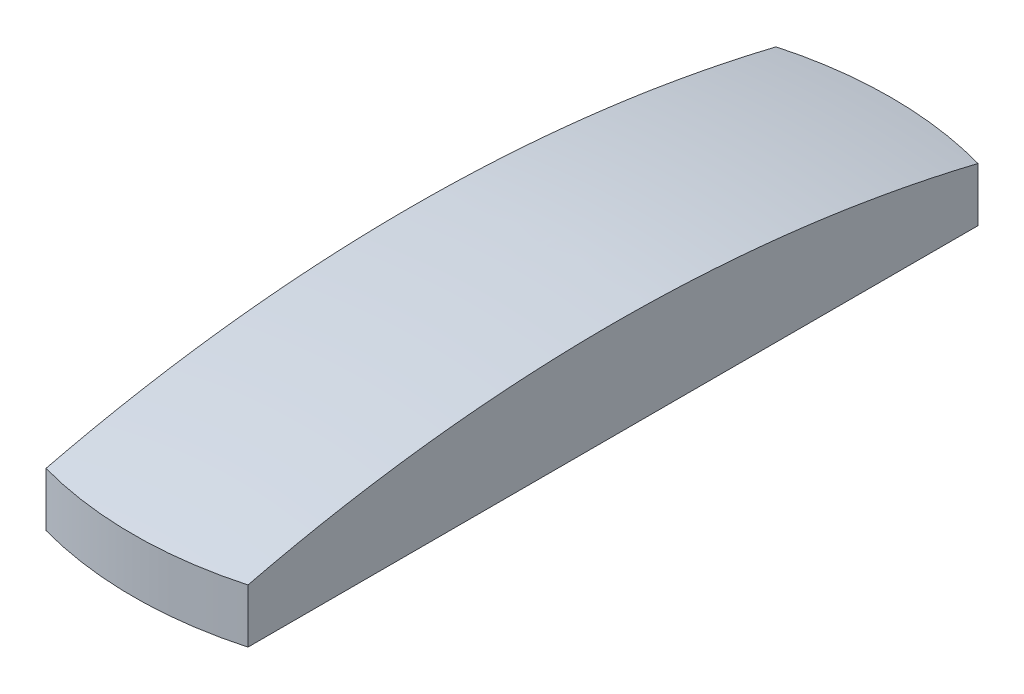
ISO-10303-21;
HEADER;
FILE_DESCRIPTION(('STEP AP214'),'2;1');
FILE_NAME('part.step','',(''),(''),'','','');
FILE_SCHEMA(('AUTOMOTIVE_DESIGN { 1 0 10303 214 1 1 1 1 }'));
ENDSEC;
DATA;
#1=APPLICATION_CONTEXT('core data for automotive mechanical design processes');
#2=APPLICATION_PROTOCOL_DEFINITION('international standard','automotive_design',2000,#1);
#3=PRODUCT_CONTEXT('',#1,'mechanical');
#4=PRODUCT('Part','Part','',(#3));
#5=PRODUCT_RELATED_PRODUCT_CATEGORY('part','',(#4));
#6=PRODUCT_DEFINITION_FORMATION('','',#4);
#7=PRODUCT_DEFINITION_CONTEXT('part definition',#1,'design');
#8=PRODUCT_DEFINITION('design','',#6,#7);
#9=PRODUCT_DEFINITION_SHAPE('','',#8);
#10=(LENGTH_UNIT() NAMED_UNIT(*) SI_UNIT(.MILLI.,.METRE.));
#11=(NAMED_UNIT(*) PLANE_ANGLE_UNIT() SI_UNIT($,.RADIAN.));
#12=(NAMED_UNIT(*) SI_UNIT($,.STERADIAN.) SOLID_ANGLE_UNIT());
#13=UNCERTAINTY_MEASURE_WITH_UNIT(LENGTH_MEASURE(1.E-05),#10,'distance_accuracy_value','');
#14=(GEOMETRIC_REPRESENTATION_CONTEXT(3) GLOBAL_UNCERTAINTY_ASSIGNED_CONTEXT((#13)) GLOBAL_UNIT_ASSIGNED_CONTEXT((#10,
#11,#12)) REPRESENTATION_CONTEXT('',''));
#15=CARTESIAN_POINT('',(0.,0.,0.));
#16=DIRECTION('',(0.,0.,1.));
#17=DIRECTION('',(1.,0.,0.));
#18=AXIS2_PLACEMENT_3D('',#15,#16,#17);
#19=CARTESIAN_POINT('',(0.,2.,0.));
#20=DIRECTION('',(0.,1.,0.));
#21=DIRECTION('',(0.,0.,1.));
#22=AXIS2_PLACEMENT_3D('',#19,#20,#21);
#23=CYLINDRICAL_SURFACE('',#22,7.5);
#24=CARTESIAN_POINT('',(0.,0.,0.));
#25=DIRECTION('',(0.,1.,0.));
#26=DIRECTION('',(0.,0.,1.));
#27=AXIS2_PLACEMENT_3D('',#24,#25,#26);
#28=CIRCLE('',#27,7.5);
#29=CARTESIAN_POINT('',(-2.,0.,7.22841614740048));
#30=VERTEX_POINT('',#29);
#31=CARTESIAN_POINT('',(2.,0.,7.22841614740048));
#32=VERTEX_POINT('',#31);
#33=EDGE_CURVE('E82',#30,#32,#28,.T.);
#34=ORIENTED_EDGE('',*,*,#33,.T.);
#35=DIRECTION('',(0.,1.,0.));
#36=VECTOR('',#35,1.);
#37=CARTESIAN_POINT('',(2.,2.,7.22841614740048));
#38=LINE('',#37,#36);
#39=CARTESIAN_POINT('',(2.,1.066647940069,7.22841614740048));
#40=VERTEX_POINT('',#39);
#41=EDGE_CURVE('E11',#32,#40,#38,.T.);
#42=ORIENTED_EDGE('',*,*,#41,.T.);
#43=CARTESIAN_POINT('',(0.,1.066647940069,0.));
#44=DIRECTION('',(0.,1.,0.));
#45=DIRECTION('',(0.,0.,1.));
#46=AXIS2_PLACEMENT_3D('',#43,#44,#45);
#47=CIRCLE('',#46,7.5);
#48=CARTESIAN_POINT('',(-2.,1.066647940069,7.22841614740048));
#49=VERTEX_POINT('',#48);
#50=EDGE_CURVE('E91',#49,#40,#47,.T.);
#51=ORIENTED_EDGE('',*,*,#50,.F.);
#52=DIRECTION('',(0.,1.,0.));
#53=VECTOR('',#52,1.);
#54=CARTESIAN_POINT('',(-2.,2.,7.22841614740048));
#55=LINE('',#54,#53);
#56=EDGE_CURVE('E86',#30,#49,#55,.T.);
#57=ORIENTED_EDGE('',*,*,#56,.F.);
#58=EDGE_LOOP('',(#34,#42,#51,#57));
#59=FACE_BOUND('',#58,.T.);
#60=ADVANCED_FACE('F31',(#59),#23,.T.);
#61=CARTESIAN_POINT('',(0.,-28.6,0.));
#62=DIRECTION('',(0.,1.,0.));
#63=DIRECTION('',(0.,0.,-1.));
#64=AXIS2_PLACEMENT_3D('',#61,#62,#63);
#65=SPHERICAL_SURFACE('',#64,30.6);
#66=ORIENTED_EDGE('',*,*,#50,.T.);
#67=CARTESIAN_POINT('',(2.,-28.6,0.));
#68=DIRECTION('',(-1.,0.,0.));
#69=DIRECTION('',(0.,0.,1.));
#70=AXIS2_PLACEMENT_3D('',#67,#68,#69);
#71=CIRCLE('',#70,30.5345705717307);
#72=CARTESIAN_POINT('',(2.,1.066647940069,-7.22841614740048));
#73=VERTEX_POINT('',#72);
#74=EDGE_CURVE('E72',#40,#73,#71,.T.);
#75=ORIENTED_EDGE('',*,*,#74,.T.);
#76=CARTESIAN_POINT('',(-2.,1.066647940069,-7.22841614740048));
#77=VERTEX_POINT('',#76);
#78=EDGE_CURVE('E54',#73,#77,#47,.T.);
#79=ORIENTED_EDGE('',*,*,#78,.T.);
#80=CARTESIAN_POINT('',(-2.,-28.6,0.));
#81=DIRECTION('',(-1.,0.,0.));
#82=DIRECTION('',(0.,0.,1.));
#83=AXIS2_PLACEMENT_3D('',#80,#81,#82);
#84=CIRCLE('',#83,30.5345705717307);
#85=EDGE_CURVE('E100',#49,#77,#84,.T.);
#86=ORIENTED_EDGE('',*,*,#85,.F.);
#87=EDGE_LOOP('',(#66,#75,#79,#86));
#88=FACE_BOUND('',#87,.T.);
#89=ADVANCED_FACE('F33',(#88),#65,.T.);
#90=CARTESIAN_POINT('',(0.,0.,0.));
#91=DIRECTION('',(0.,1.,0.));
#92=DIRECTION('',(0.,0.,1.));
#93=AXIS2_PLACEMENT_3D('',#90,#91,#92);
#94=PLANE('',#93);
#95=CARTESIAN_POINT('',(2.,0.,-7.22841614740048));
#96=VERTEX_POINT('',#95);
#97=CARTESIAN_POINT('',(-2.,0.,-7.22841614740048));
#98=VERTEX_POINT('',#97);
#99=EDGE_CURVE('E83',#96,#98,#28,.T.);
#100=ORIENTED_EDGE('',*,*,#99,.F.);
#101=DIRECTION('',(0.,0.,-1.));
#102=VECTOR('',#101,1.);
#103=CARTESIAN_POINT('',(2.,0.,-16.6414213562373));
#104=LINE('',#103,#102);
#105=EDGE_CURVE('E46',#32,#96,#104,.T.);
#106=ORIENTED_EDGE('',*,*,#105,.F.);
#107=ORIENTED_EDGE('',*,*,#33,.F.);
#108=DIRECTION('',(0.,0.,-1.));
#109=VECTOR('',#108,1.);
#110=CARTESIAN_POINT('',(-2.,0.,-16.6414213562373));
#111=LINE('',#110,#109);
#112=EDGE_CURVE('E98',#30,#98,#111,.T.);
#113=ORIENTED_EDGE('',*,*,#112,.T.);
#114=EDGE_LOOP('',(#100,#106,#107,#113));
#115=FACE_BOUND('',#114,.T.);
#116=ADVANCED_FACE('F80',(#115),#94,.F.);
#117=ORIENTED_EDGE('',*,*,#78,.F.);
#118=DIRECTION('',(0.,1.,0.));
#119=VECTOR('',#118,1.);
#120=CARTESIAN_POINT('',(2.,2.,-7.22841614740048));
#121=LINE('',#120,#119);
#122=EDGE_CURVE('E39',#73,#96,#121,.F.);
#123=ORIENTED_EDGE('',*,*,#122,.T.);
#124=ORIENTED_EDGE('',*,*,#99,.T.);
#125=DIRECTION('',(0.,1.,0.));
#126=VECTOR('',#125,1.);
#127=CARTESIAN_POINT('',(-2.,2.,-7.22841614740048));
#128=LINE('',#127,#126);
#129=EDGE_CURVE('E87',#77,#98,#128,.F.);
#130=ORIENTED_EDGE('',*,*,#129,.F.);
#131=EDGE_LOOP('',(#117,#123,#124,#130));
#132=FACE_BOUND('',#131,.T.);
#133=ADVANCED_FACE('F96',(#132),#23,.T.);
#134=CARTESIAN_POINT('',(-2.,2.,-16.6414213562373));
#135=DIRECTION('',(-1.,0.,0.));
#136=DIRECTION('',(0.,0.,1.));
#137=AXIS2_PLACEMENT_3D('',#134,#135,#136);
#138=PLANE('',#137);
#139=ORIENTED_EDGE('',*,*,#85,.T.);
#140=ORIENTED_EDGE('',*,*,#129,.T.);
#141=ORIENTED_EDGE('',*,*,#112,.F.);
#142=ORIENTED_EDGE('',*,*,#56,.T.);
#143=EDGE_LOOP('',(#139,#140,#141,#142));
#144=FACE_BOUND('',#143,.T.);
#145=ADVANCED_FACE('F103',(#144),#138,.T.);
#146=CARTESIAN_POINT('',(2.,2.,-16.6414213562373));
#147=DIRECTION('',(-1.,0.,0.));
#148=DIRECTION('',(0.,0.,1.));
#149=AXIS2_PLACEMENT_3D('',#146,#147,#148);
#150=PLANE('',#149);
#151=ORIENTED_EDGE('',*,*,#41,.F.);
#152=ORIENTED_EDGE('',*,*,#105,.T.);
#153=ORIENTED_EDGE('',*,*,#122,.F.);
#154=ORIENTED_EDGE('',*,*,#74,.F.);
#155=EDGE_LOOP('',(#151,#152,#153,#154));
#156=FACE_BOUND('',#155,.T.);
#157=ADVANCED_FACE('F71',(#156),#150,.F.);
#158=CLOSED_SHELL('',(#60,#89,#116,#133,#145,#157));
#159=MANIFOLD_SOLID_BREP('B2',#158);
#160=ADVANCED_BREP_SHAPE_REPRESENTATION('',(#18,#159),#14);
#161=SHAPE_DEFINITION_REPRESENTATION(#9,#160);
ENDSEC;
END-ISO-10303-21;
